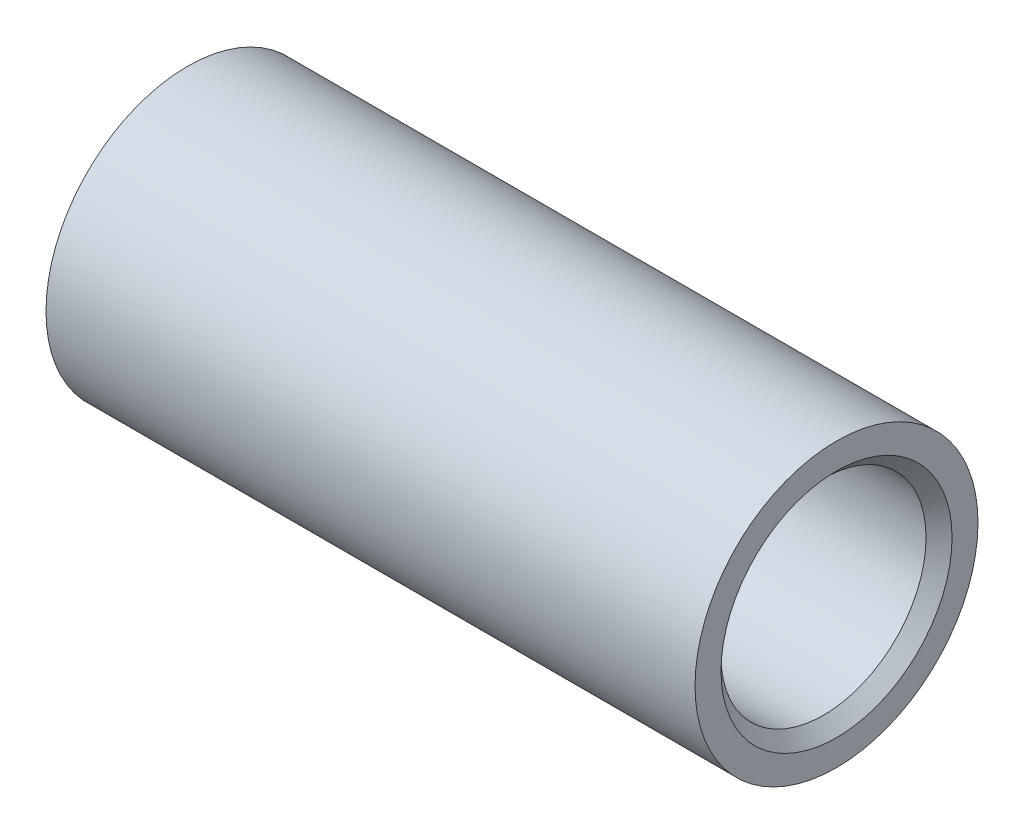
ISO-10303-21;
HEADER;
FILE_DESCRIPTION(('STEP AP214'),'2;1');
FILE_NAME('part.step','',(''),(''),'','','');
FILE_SCHEMA(('AUTOMOTIVE_DESIGN { 1 0 10303 214 1 1 1 1 }'));
ENDSEC;
DATA;
#1=APPLICATION_CONTEXT('core data for automotive mechanical design processes');
#2=APPLICATION_PROTOCOL_DEFINITION('international standard','automotive_design',2000,#1);
#3=PRODUCT_CONTEXT('',#1,'mechanical');
#4=PRODUCT('Part','Part','',(#3));
#5=PRODUCT_RELATED_PRODUCT_CATEGORY('part','',(#4));
#6=PRODUCT_DEFINITION_FORMATION('','',#4);
#7=PRODUCT_DEFINITION_CONTEXT('part definition',#1,'design');
#8=PRODUCT_DEFINITION('design','',#6,#7);
#9=PRODUCT_DEFINITION_SHAPE('','',#8);
#10=(LENGTH_UNIT() NAMED_UNIT(*) SI_UNIT(.MILLI.,.METRE.));
#11=(NAMED_UNIT(*) PLANE_ANGLE_UNIT() SI_UNIT($,.RADIAN.));
#12=(NAMED_UNIT(*) SI_UNIT($,.STERADIAN.) SOLID_ANGLE_UNIT());
#13=UNCERTAINTY_MEASURE_WITH_UNIT(LENGTH_MEASURE(1.E-05),#10,'distance_accuracy_value','');
#14=(GEOMETRIC_REPRESENTATION_CONTEXT(3) GLOBAL_UNCERTAINTY_ASSIGNED_CONTEXT((#13)) GLOBAL_UNIT_ASSIGNED_CONTEXT((#10,
#11,#12)) REPRESENTATION_CONTEXT('',''));
#15=CARTESIAN_POINT('',(0.,0.,0.));
#16=DIRECTION('',(0.,0.,1.));
#17=DIRECTION('',(1.,0.,0.));
#18=AXIS2_PLACEMENT_3D('',#15,#16,#17);
#19=CARTESIAN_POINT('',(0.,2.7686,0.));
#20=DIRECTION('',(1.,0.,0.));
#21=DIRECTION('',(0.,0.,-1.));
#22=AXIS2_PLACEMENT_3D('',#19,#20,#21);
#23=PLANE('',#22);
#24=CARTESIAN_POINT('',(0.,0.,0.));
#25=DIRECTION('',(-1.,0.,0.));
#26=DIRECTION('',(0.,0.,1.));
#27=AXIS2_PLACEMENT_3D('',#24,#25,#26);
#28=CIRCLE('',#27,2.0066);
#29=CARTESIAN_POINT('',(0.,0.,2.0066));
#30=VERTEX_POINT('',#29);
#31=EDGE_CURVE('E93',#30,#30,#28,.T.);
#32=ORIENTED_EDGE('',*,*,#31,.F.);
#33=EDGE_LOOP('',(#32));
#34=FACE_BOUND('',#33,.T.);
#35=CARTESIAN_POINT('',(0.,0.,0.));
#36=DIRECTION('',(-1.,0.,0.));
#37=DIRECTION('',(0.,0.,1.));
#38=AXIS2_PLACEMENT_3D('',#35,#36,#37);
#39=CIRCLE('',#38,2.7686);
#40=CARTESIAN_POINT('',(0.,0.,2.7686));
#41=VERTEX_POINT('',#40);
#42=EDGE_CURVE('E66',#41,#41,#39,.T.);
#43=ORIENTED_EDGE('',*,*,#42,.T.);
#44=EDGE_LOOP('',(#43));
#45=FACE_BOUND('',#44,.T.);
#46=ADVANCED_FACE('F52',(#34,#45),#23,.F.);
#47=CARTESIAN_POINT('',(-4.56175733291189,0.,0.));
#48=DIRECTION('',(-1.,0.,0.));
#49=DIRECTION('',(0.,0.,1.));
#50=AXIS2_PLACEMENT_3D('',#47,#48,#49);
#51=CYLINDRICAL_SURFACE('',#50,2.7686);
#52=ORIENTED_EDGE('',*,*,#42,.F.);
#53=EDGE_LOOP('',(#52));
#54=FACE_BOUND('',#53,.T.);
#55=CARTESIAN_POINT('',(12.7,0.,0.));
#56=DIRECTION('',(-1.,0.,0.));
#57=DIRECTION('',(0.,0.,1.));
#58=AXIS2_PLACEMENT_3D('',#55,#56,#57);
#59=CIRCLE('',#58,2.7686);
#60=CARTESIAN_POINT('',(12.7,0.,2.7686));
#61=VERTEX_POINT('',#60);
#62=EDGE_CURVE('E71',#61,#61,#59,.T.);
#63=ORIENTED_EDGE('',*,*,#62,.T.);
#64=EDGE_LOOP('',(#63));
#65=FACE_BOUND('',#64,.T.);
#66=ADVANCED_FACE('F102',(#54,#65),#51,.T.);
#67=CARTESIAN_POINT('',(12.7,2.7686,0.));
#68=DIRECTION('',(-1.,0.,0.));
#69=DIRECTION('',(0.,0.,1.));
#70=AXIS2_PLACEMENT_3D('',#67,#68,#69);
#71=PLANE('',#70);
#72=CARTESIAN_POINT('',(12.7,0.,0.));
#73=DIRECTION('',(-1.,0.,0.));
#74=DIRECTION('',(0.,0.,1.));
#75=AXIS2_PLACEMENT_3D('',#72,#73,#74);
#76=CIRCLE('',#75,2.2606);
#77=CARTESIAN_POINT('',(12.7,0.,2.2606));
#78=VERTEX_POINT('',#77);
#79=EDGE_CURVE('E61',#78,#78,#76,.T.);
#80=ORIENTED_EDGE('',*,*,#79,.T.);
#81=EDGE_LOOP('',(#80));
#82=FACE_BOUND('',#81,.T.);
#83=ORIENTED_EDGE('',*,*,#62,.F.);
#84=EDGE_LOOP('',(#83));
#85=FACE_BOUND('',#84,.T.);
#86=ADVANCED_FACE('F107',(#82,#85),#71,.F.);
#87=CARTESIAN_POINT('',(-4.56175733291189,0.,0.));
#88=DIRECTION('',(-1.,0.,0.));
#89=DIRECTION('',(0.,0.,1.));
#90=AXIS2_PLACEMENT_3D('',#87,#88,#89);
#91=CYLINDRICAL_SURFACE('',#90,2.0066);
#92=CARTESIAN_POINT('',(12.446,0.,0.));
#93=DIRECTION('',(-1.,0.,0.));
#94=DIRECTION('',(0.,0.,1.));
#95=AXIS2_PLACEMENT_3D('',#92,#93,#94);
#96=CIRCLE('',#95,2.0066);
#97=CARTESIAN_POINT('',(12.446,0.,2.0066));
#98=VERTEX_POINT('',#97);
#99=EDGE_CURVE('E12',#98,#98,#96,.F.);
#100=ORIENTED_EDGE('',*,*,#99,.T.);
#101=EDGE_LOOP('',(#100));
#102=FACE_BOUND('',#101,.T.);
#103=CARTESIAN_POINT('',(4.3434,0.,0.));
#104=DIRECTION('',(-1.,0.,0.));
#105=DIRECTION('',(0.,0.,1.));
#106=AXIS2_PLACEMENT_3D('',#103,#104,#105);
#107=CIRCLE('',#106,2.0066);
#108=CARTESIAN_POINT('',(4.3434,0.,2.0066));
#109=VERTEX_POINT('',#108);
#110=EDGE_CURVE('E77',#109,#109,#107,.T.);
#111=ORIENTED_EDGE('',*,*,#110,.T.);
#112=EDGE_LOOP('',(#111));
#113=FACE_BOUND('',#112,.T.);
#114=ADVANCED_FACE('F112',(#102,#113),#91,.F.);
#115=CARTESIAN_POINT('',(2.4531587330311,0.,0.));
#116=DIRECTION('',(-1.,0.,0.));
#117=DIRECTION('',(0.,0.,1.));
#118=AXIS2_PLACEMENT_3D('',#115,#116,#117);
#119=DEGENERATE_TOROIDAL_SURFACE('',#118,0.30995980459975,2.54,.T.);
#120=ORIENTED_EDGE('',*,*,#110,.F.);
#121=EDGE_LOOP('',(#120));
#122=FACE_BOUND('',#121,.T.);
#123=CARTESIAN_POINT('',(4.99216509195135,0.,0.));
#124=DIRECTION('',(-1.,0.,0.));
#125=DIRECTION('',(0.,0.,1.));
#126=AXIS2_PLACEMENT_3D('',#123,#124,#125);
#127=CIRCLE('',#126,0.381);
#128=CARTESIAN_POINT('',(4.99216509195135,0.,0.381));
#129=VERTEX_POINT('',#128);
#130=EDGE_CURVE('E81',#129,#129,#127,.T.);
#131=ORIENTED_EDGE('',*,*,#130,.T.);
#132=EDGE_LOOP('',(#131));
#133=FACE_BOUND('',#132,.T.);
#134=ADVANCED_FACE('F117',(#122,#133),#119,.T.);
#135=CARTESIAN_POINT('',(-4.56175733291189,0.,0.));
#136=DIRECTION('',(-1.,0.,0.));
#137=DIRECTION('',(0.,0.,1.));
#138=AXIS2_PLACEMENT_3D('',#135,#136,#137);
#139=CYLINDRICAL_SURFACE('',#138,0.381);
#140=ORIENTED_EDGE('',*,*,#130,.F.);
#141=EDGE_LOOP('',(#140));
#142=FACE_BOUND('',#141,.T.);
#143=CARTESIAN_POINT('',(4.48416509195135,0.,0.));
#144=DIRECTION('',(-1.,0.,0.));
#145=DIRECTION('',(0.,0.,1.));
#146=AXIS2_PLACEMENT_3D('',#143,#144,#145);
#147=CIRCLE('',#146,0.381);
#148=CARTESIAN_POINT('',(4.48416509195135,0.,0.381));
#149=VERTEX_POINT('',#148);
#150=EDGE_CURVE('E85',#149,#149,#147,.T.);
#151=ORIENTED_EDGE('',*,*,#150,.T.);
#152=EDGE_LOOP('',(#151));
#153=FACE_BOUND('',#152,.T.);
#154=ADVANCED_FACE('F122',(#142,#153),#139,.F.);
#155=CARTESIAN_POINT('',(1.9451587330311,0.,0.));
#156=DIRECTION('',(-1.,0.,0.));
#157=DIRECTION('',(0.,0.,1.));
#158=AXIS2_PLACEMENT_3D('',#155,#156,#157);
#159=DEGENERATE_TOROIDAL_SURFACE('',#158,0.309959804599751,2.54,.T.);
#160=ORIENTED_EDGE('',*,*,#150,.F.);
#161=EDGE_LOOP('',(#160));
#162=FACE_BOUND('',#161,.T.);
#163=CARTESIAN_POINT('',(3.8354,0.,0.));
#164=DIRECTION('',(-1.,0.,0.));
#165=DIRECTION('',(0.,0.,1.));
#166=AXIS2_PLACEMENT_3D('',#163,#164,#165);
#167=CIRCLE('',#166,2.0066);
#168=CARTESIAN_POINT('',(3.8354,0.,2.0066));
#169=VERTEX_POINT('',#168);
#170=EDGE_CURVE('E89',#169,#169,#167,.T.);
#171=ORIENTED_EDGE('',*,*,#170,.T.);
#172=EDGE_LOOP('',(#171));
#173=FACE_BOUND('',#172,.T.);
#174=ADVANCED_FACE('F126',(#162,#173),#159,.F.);
#175=CARTESIAN_POINT('',(-4.56175733291189,0.,0.));
#176=DIRECTION('',(-1.,0.,0.));
#177=DIRECTION('',(0.,0.,1.));
#178=AXIS2_PLACEMENT_3D('',#175,#176,#177);
#179=CYLINDRICAL_SURFACE('',#178,2.0066);
#180=ORIENTED_EDGE('',*,*,#170,.F.);
#181=EDGE_LOOP('',(#180));
#182=FACE_BOUND('',#181,.T.);
#183=ORIENTED_EDGE('',*,*,#31,.T.);
#184=EDGE_LOOP('',(#183));
#185=FACE_BOUND('',#184,.T.);
#186=ADVANCED_FACE('F98',(#182,#185),#179,.F.);
#187=CARTESIAN_POINT('',(12.7,0.,0.));
#188=DIRECTION('',(1.,0.,0.));
#189=DIRECTION('',(0.,0.,-1.));
#190=AXIS2_PLACEMENT_3D('',#187,#188,#189);
#191=CONICAL_SURFACE('',#190,2.2606,0.785398163397444);
#192=ORIENTED_EDGE('',*,*,#99,.F.);
#193=EDGE_LOOP('',(#192));
#194=FACE_BOUND('',#193,.T.);
#195=ORIENTED_EDGE('',*,*,#79,.F.);
#196=EDGE_LOOP('',(#195));
#197=FACE_BOUND('',#196,.T.);
#198=ADVANCED_FACE('F55',(#194,#197),#191,.F.);
#199=CLOSED_SHELL('',(#46,#66,#86,#114,#134,#154,#174,#186,#198));
#200=MANIFOLD_SOLID_BREP('B2',#199);
#201=ADVANCED_BREP_SHAPE_REPRESENTATION('',(#18,#200),#14);
#202=SHAPE_DEFINITION_REPRESENTATION(#9,#201);
ENDSEC;
END-ISO-10303-21;
